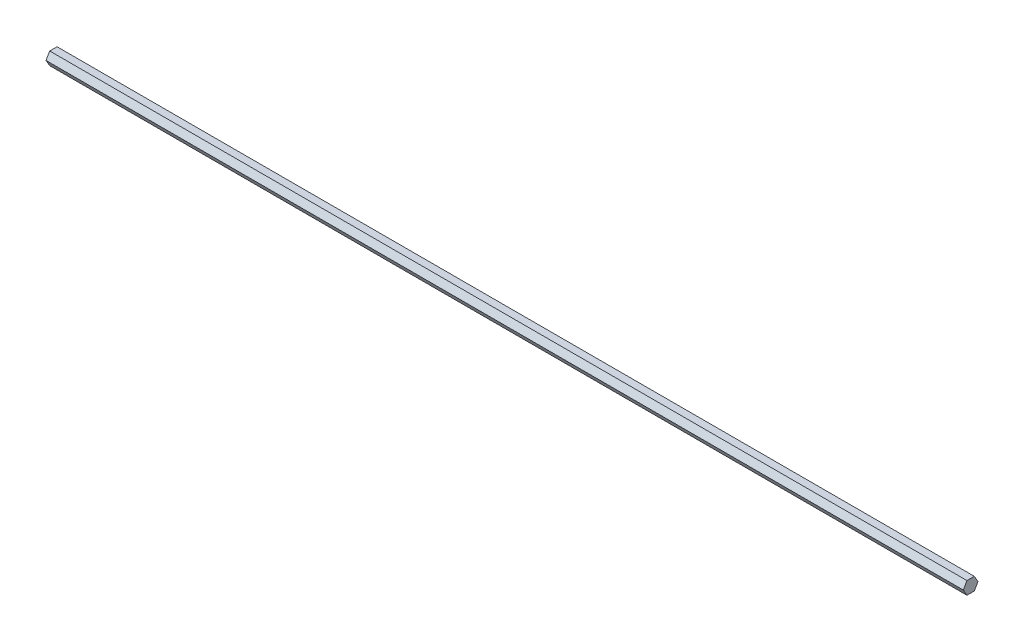
ISO-10303-21;
HEADER;
FILE_DESCRIPTION(('STEP AP214'),'2;1');
FILE_NAME('part.step','',(''),(''),'','','');
FILE_SCHEMA(('AUTOMOTIVE_DESIGN { 1 0 10303 214 1 1 1 1 }'));
ENDSEC;
DATA;
#1=APPLICATION_CONTEXT('core data for automotive mechanical design processes');
#2=APPLICATION_PROTOCOL_DEFINITION('international standard','automotive_design',2000,#1);
#3=PRODUCT_CONTEXT('',#1,'mechanical');
#4=PRODUCT('Part','Part','',(#3));
#5=PRODUCT_RELATED_PRODUCT_CATEGORY('part','',(#4));
#6=PRODUCT_DEFINITION_FORMATION('','',#4);
#7=PRODUCT_DEFINITION_CONTEXT('part definition',#1,'design');
#8=PRODUCT_DEFINITION('design','',#6,#7);
#9=PRODUCT_DEFINITION_SHAPE('','',#8);
#10=(LENGTH_UNIT() NAMED_UNIT(*) SI_UNIT(.MILLI.,.METRE.));
#11=(NAMED_UNIT(*) PLANE_ANGLE_UNIT() SI_UNIT($,.RADIAN.));
#12=(NAMED_UNIT(*) SI_UNIT($,.STERADIAN.) SOLID_ANGLE_UNIT());
#13=UNCERTAINTY_MEASURE_WITH_UNIT(LENGTH_MEASURE(1.E-05),#10,'distance_accuracy_value','');
#14=(GEOMETRIC_REPRESENTATION_CONTEXT(3) GLOBAL_UNCERTAINTY_ASSIGNED_CONTEXT((#13)) GLOBAL_UNIT_ASSIGNED_CONTEXT((#10,
#11,#12)) REPRESENTATION_CONTEXT('',''));
#15=CARTESIAN_POINT('',(0.,0.,0.));
#16=DIRECTION('',(0.,0.,1.));
#17=DIRECTION('',(1.,0.,0.));
#18=AXIS2_PLACEMENT_3D('',#15,#16,#17);
#19=CARTESIAN_POINT('',(914.4,-6.35,-3.66617420935412));
#20=DIRECTION('',(0.,0.5,0.866025403784439));
#21=DIRECTION('',(0.,-0.866025403784439,0.5));
#22=AXIS2_PLACEMENT_3D('',#19,#20,#21);
#23=PLANE('',#22);
#24=DIRECTION('',(0.,0.866025403784439,-0.5));
#25=VECTOR('',#24,1.);
#26=CARTESIAN_POINT('',(0.,-6.35,-3.66617420935412));
#27=LINE('',#26,#25);
#28=CARTESIAN_POINT('',(0.,-6.35,-3.66617420935412));
#29=VERTEX_POINT('',#28);
#30=CARTESIAN_POINT('',(0.,0.,-7.33234841870825));
#31=VERTEX_POINT('',#30);
#32=EDGE_CURVE('E120',#29,#31,#27,.T.);
#33=ORIENTED_EDGE('',*,*,#32,.T.);
#34=DIRECTION('',(-1.,0.,0.));
#35=VECTOR('',#34,1.);
#36=CARTESIAN_POINT('',(914.4,0.,-7.33234841870825));
#37=LINE('',#36,#35);
#38=CARTESIAN_POINT('',(914.4,0.,-7.33234841870825));
#39=VERTEX_POINT('',#38);
#40=EDGE_CURVE('E11',#39,#31,#37,.T.);
#41=ORIENTED_EDGE('',*,*,#40,.F.);
#42=DIRECTION('',(0.,0.866025403784439,-0.5));
#43=VECTOR('',#42,1.);
#44=CARTESIAN_POINT('',(914.4,-6.35,-3.66617420935412));
#45=LINE('',#44,#43);
#46=CARTESIAN_POINT('',(914.4,-6.35,-3.66617420935412));
#47=VERTEX_POINT('',#46);
#48=EDGE_CURVE('E130',#47,#39,#45,.T.);
#49=ORIENTED_EDGE('',*,*,#48,.F.);
#50=DIRECTION('',(-1.,0.,0.));
#51=VECTOR('',#50,1.);
#52=CARTESIAN_POINT('',(914.4,-6.35,-3.66617420935412));
#53=LINE('',#52,#51);
#54=EDGE_CURVE('E116',#47,#29,#53,.T.);
#55=ORIENTED_EDGE('',*,*,#54,.T.);
#56=EDGE_LOOP('',(#33,#41,#49,#55));
#57=FACE_BOUND('',#56,.T.);
#58=ADVANCED_FACE('F36',(#57),#23,.F.);
#59=CARTESIAN_POINT('',(914.4,0.,-7.33234841870825));
#60=DIRECTION('',(0.,-0.500000000000001,0.866025403784438));
#61=DIRECTION('',(0.,-0.866025403784438,-0.500000000000001));
#62=AXIS2_PLACEMENT_3D('',#59,#60,#61);
#63=PLANE('',#62);
#64=DIRECTION('',(0.,0.866025403784438,0.500000000000001));
#65=VECTOR('',#64,1.);
#66=CARTESIAN_POINT('',(0.,0.,-7.33234841870825));
#67=LINE('',#66,#65);
#68=CARTESIAN_POINT('',(0.,6.35,-3.66617420935412));
#69=VERTEX_POINT('',#68);
#70=EDGE_CURVE('E123',#31,#69,#67,.T.);
#71=ORIENTED_EDGE('',*,*,#70,.T.);
#72=DIRECTION('',(-1.,0.,0.));
#73=VECTOR('',#72,1.);
#74=CARTESIAN_POINT('',(914.4,6.35,-3.66617420935412));
#75=LINE('',#74,#73);
#76=CARTESIAN_POINT('',(914.4,6.35,-3.66617420935412));
#77=VERTEX_POINT('',#76);
#78=EDGE_CURVE('E44',#77,#69,#75,.T.);
#79=ORIENTED_EDGE('',*,*,#78,.F.);
#80=DIRECTION('',(0.,0.866025403784438,0.500000000000001));
#81=VECTOR('',#80,1.);
#82=CARTESIAN_POINT('',(914.4,0.,-7.33234841870825));
#83=LINE('',#82,#81);
#84=EDGE_CURVE('E89',#39,#77,#83,.T.);
#85=ORIENTED_EDGE('',*,*,#84,.F.);
#86=ORIENTED_EDGE('',*,*,#40,.T.);
#87=EDGE_LOOP('',(#71,#79,#85,#86));
#88=FACE_BOUND('',#87,.T.);
#89=ADVANCED_FACE('F154',(#88),#63,.F.);
#90=CARTESIAN_POINT('',(914.4,6.35,-3.66617420935412));
#91=DIRECTION('',(0.,-1.,0.));
#92=DIRECTION('',(0.,0.,-1.));
#93=AXIS2_PLACEMENT_3D('',#90,#91,#92);
#94=PLANE('',#93);
#95=DIRECTION('',(0.,0.,1.));
#96=VECTOR('',#95,1.);
#97=CARTESIAN_POINT('',(0.,6.35,-3.66617420935412));
#98=LINE('',#97,#96);
#99=CARTESIAN_POINT('',(0.,6.35,3.66617420935412));
#100=VERTEX_POINT('',#99);
#101=EDGE_CURVE('E125',#69,#100,#98,.T.);
#102=ORIENTED_EDGE('',*,*,#101,.T.);
#103=DIRECTION('',(-1.,0.,0.));
#104=VECTOR('',#103,1.);
#105=CARTESIAN_POINT('',(914.4,6.35,3.66617420935412));
#106=LINE('',#105,#104);
#107=CARTESIAN_POINT('',(914.4,6.35,3.66617420935412));
#108=VERTEX_POINT('',#107);
#109=EDGE_CURVE('E111',#108,#100,#106,.T.);
#110=ORIENTED_EDGE('',*,*,#109,.F.);
#111=DIRECTION('',(0.,0.,1.));
#112=VECTOR('',#111,1.);
#113=CARTESIAN_POINT('',(914.4,6.35,-3.66617420935412));
#114=LINE('',#113,#112);
#115=EDGE_CURVE('E102',#77,#108,#114,.T.);
#116=ORIENTED_EDGE('',*,*,#115,.F.);
#117=ORIENTED_EDGE('',*,*,#78,.T.);
#118=EDGE_LOOP('',(#102,#110,#116,#117));
#119=FACE_BOUND('',#118,.T.);
#120=ADVANCED_FACE('F136',(#119),#94,.F.);
#121=CARTESIAN_POINT('',(914.4,6.35,3.66617420935412));
#122=DIRECTION('',(0.,-0.5,-0.866025403784439));
#123=DIRECTION('',(0.,0.866025403784439,-0.5));
#124=AXIS2_PLACEMENT_3D('',#121,#122,#123);
#125=PLANE('',#124);
#126=DIRECTION('',(0.,-0.866025403784439,0.5));
#127=VECTOR('',#126,1.);
#128=CARTESIAN_POINT('',(0.,6.35,3.66617420935412));
#129=LINE('',#128,#127);
#130=CARTESIAN_POINT('',(0.,0.,7.33234841870825));
#131=VERTEX_POINT('',#130);
#132=EDGE_CURVE('E110',#100,#131,#129,.T.);
#133=ORIENTED_EDGE('',*,*,#132,.T.);
#134=DIRECTION('',(-1.,0.,0.));
#135=VECTOR('',#134,1.);
#136=CARTESIAN_POINT('',(914.4,0.,7.33234841870825));
#137=LINE('',#136,#135);
#138=CARTESIAN_POINT('',(914.4,0.,7.33234841870825));
#139=VERTEX_POINT('',#138);
#140=EDGE_CURVE('E107',#139,#131,#137,.T.);
#141=ORIENTED_EDGE('',*,*,#140,.F.);
#142=DIRECTION('',(0.,-0.866025403784439,0.5));
#143=VECTOR('',#142,1.);
#144=CARTESIAN_POINT('',(914.4,6.35,3.66617420935412));
#145=LINE('',#144,#143);
#146=EDGE_CURVE('E96',#108,#139,#145,.T.);
#147=ORIENTED_EDGE('',*,*,#146,.F.);
#148=ORIENTED_EDGE('',*,*,#109,.T.);
#149=EDGE_LOOP('',(#133,#141,#147,#148));
#150=FACE_BOUND('',#149,.T.);
#151=ADVANCED_FACE('F108',(#150),#125,.F.);
#152=CARTESIAN_POINT('',(914.4,0.,7.33234841870825));
#153=DIRECTION('',(0.,0.5,-0.866025403784438));
#154=DIRECTION('',(0.,0.866025403784439,0.5));
#155=AXIS2_PLACEMENT_3D('',#152,#153,#154);
#156=PLANE('',#155);
#157=DIRECTION('',(0.,-0.866025403784438,-0.5));
#158=VECTOR('',#157,1.);
#159=CARTESIAN_POINT('',(0.,0.,7.33234841870825));
#160=LINE('',#159,#158);
#161=CARTESIAN_POINT('',(0.,-6.35,3.66617420935412));
#162=VERTEX_POINT('',#161);
#163=EDGE_CURVE('E75',#131,#162,#160,.T.);
#164=ORIENTED_EDGE('',*,*,#163,.T.);
#165=DIRECTION('',(-1.,0.,0.));
#166=VECTOR('',#165,1.);
#167=CARTESIAN_POINT('',(914.4,-6.35,3.66617420935412));
#168=LINE('',#167,#166);
#169=CARTESIAN_POINT('',(914.4,-6.35,3.66617420935412));
#170=VERTEX_POINT('',#169);
#171=EDGE_CURVE('E112',#170,#162,#168,.T.);
#172=ORIENTED_EDGE('',*,*,#171,.F.);
#173=DIRECTION('',(0.,-0.866025403784438,-0.5));
#174=VECTOR('',#173,1.);
#175=CARTESIAN_POINT('',(914.4,0.,7.33234841870825));
#176=LINE('',#175,#174);
#177=EDGE_CURVE('E100',#139,#170,#176,.T.);
#178=ORIENTED_EDGE('',*,*,#177,.F.);
#179=ORIENTED_EDGE('',*,*,#140,.T.);
#180=EDGE_LOOP('',(#164,#172,#178,#179));
#181=FACE_BOUND('',#180,.T.);
#182=ADVANCED_FACE('F114',(#181),#156,.F.);
#183=CARTESIAN_POINT('',(914.4,-6.35,3.66617420935412));
#184=DIRECTION('',(0.,1.,0.));
#185=DIRECTION('',(0.,0.,1.));
#186=AXIS2_PLACEMENT_3D('',#183,#184,#185);
#187=PLANE('',#186);
#188=DIRECTION('',(0.,0.,-1.));
#189=VECTOR('',#188,1.);
#190=CARTESIAN_POINT('',(0.,-6.35,3.66617420935412));
#191=LINE('',#190,#189);
#192=EDGE_CURVE('E81',#162,#29,#191,.T.);
#193=ORIENTED_EDGE('',*,*,#192,.T.);
#194=ORIENTED_EDGE('',*,*,#54,.F.);
#195=DIRECTION('',(0.,0.,-1.));
#196=VECTOR('',#195,1.);
#197=CARTESIAN_POINT('',(914.4,-6.35,3.66617420935412));
#198=LINE('',#197,#196);
#199=EDGE_CURVE('E52',#170,#47,#198,.T.);
#200=ORIENTED_EDGE('',*,*,#199,.F.);
#201=ORIENTED_EDGE('',*,*,#171,.T.);
#202=EDGE_LOOP('',(#193,#194,#200,#201));
#203=FACE_BOUND('',#202,.T.);
#204=ADVANCED_FACE('F143',(#203),#187,.F.);
#205=CARTESIAN_POINT('',(914.4,0.,0.));
#206=DIRECTION('',(1.,0.,0.));
#207=DIRECTION('',(0.,0.,-1.));
#208=AXIS2_PLACEMENT_3D('',#205,#206,#207);
#209=PLANE('',#208);
#210=ORIENTED_EDGE('',*,*,#48,.T.);
#211=ORIENTED_EDGE('',*,*,#84,.T.);
#212=ORIENTED_EDGE('',*,*,#115,.T.);
#213=ORIENTED_EDGE('',*,*,#146,.T.);
#214=ORIENTED_EDGE('',*,*,#177,.T.);
#215=ORIENTED_EDGE('',*,*,#199,.T.);
#216=EDGE_LOOP('',(#210,#211,#212,#213,#214,#215));
#217=FACE_BOUND('',#216,.T.);
#218=ADVANCED_FACE('F98',(#217),#209,.T.);
#219=CARTESIAN_POINT('',(0.,0.,0.));
#220=DIRECTION('',(1.,0.,0.));
#221=DIRECTION('',(0.,0.,-1.));
#222=AXIS2_PLACEMENT_3D('',#219,#220,#221);
#223=PLANE('',#222);
#224=ORIENTED_EDGE('',*,*,#32,.F.);
#225=ORIENTED_EDGE('',*,*,#192,.F.);
#226=ORIENTED_EDGE('',*,*,#163,.F.);
#227=ORIENTED_EDGE('',*,*,#132,.F.);
#228=ORIENTED_EDGE('',*,*,#101,.F.);
#229=ORIENTED_EDGE('',*,*,#70,.F.);
#230=EDGE_LOOP('',(#224,#225,#226,#227,#228,#229));
#231=FACE_BOUND('',#230,.T.);
#232=ADVANCED_FACE('F139',(#231),#223,.F.);
#233=CLOSED_SHELL('',(#58,#89,#120,#151,#182,#204,#218,#232));
#234=MANIFOLD_SOLID_BREP('B2',#233);
#235=ADVANCED_BREP_SHAPE_REPRESENTATION('',(#18,#234),#14);
#236=SHAPE_DEFINITION_REPRESENTATION(#9,#235);
ENDSEC;
END-ISO-10303-21;
